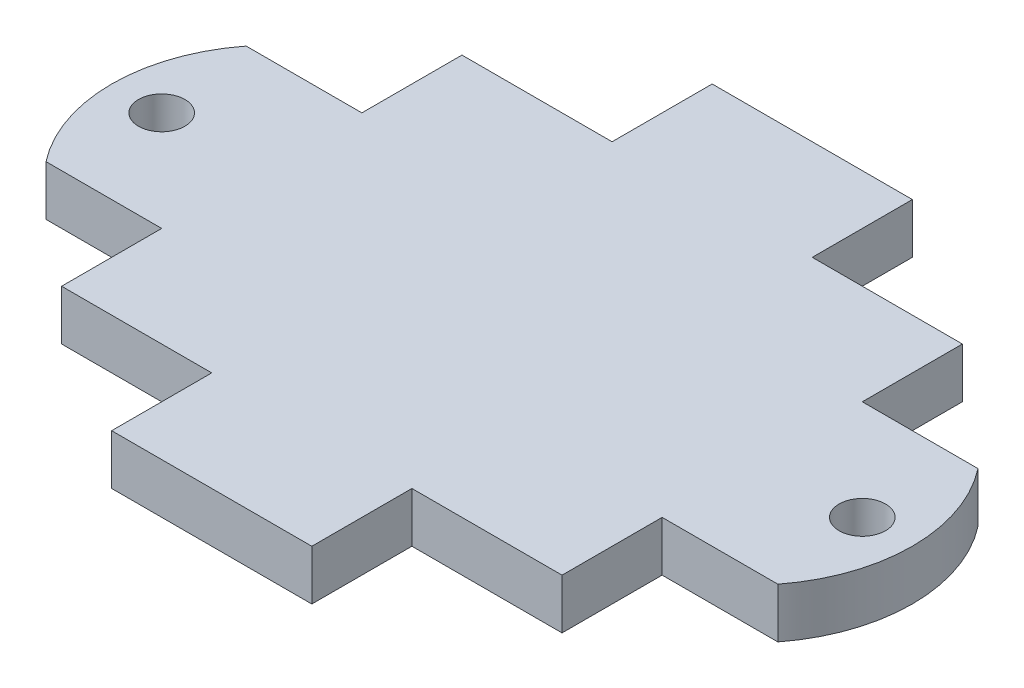
ISO-10303-21;
HEADER;
FILE_DESCRIPTION(('STEP AP214'),'2;1');
FILE_NAME('part.step','',(''),(''),'','','');
FILE_SCHEMA(('AUTOMOTIVE_DESIGN { 1 0 10303 214 1 1 1 1 }'));
ENDSEC;
DATA;
#1=APPLICATION_CONTEXT('core data for automotive mechanical design processes');
#2=APPLICATION_PROTOCOL_DEFINITION('international standard','automotive_design',2000,#1);
#3=PRODUCT_CONTEXT('',#1,'mechanical');
#4=PRODUCT('Part','Part','',(#3));
#5=PRODUCT_RELATED_PRODUCT_CATEGORY('part','',(#4));
#6=PRODUCT_DEFINITION_FORMATION('','',#4);
#7=PRODUCT_DEFINITION_CONTEXT('part definition',#1,'design');
#8=PRODUCT_DEFINITION('design','',#6,#7);
#9=PRODUCT_DEFINITION_SHAPE('','',#8);
#10=(LENGTH_UNIT() NAMED_UNIT(*) SI_UNIT(.MILLI.,.METRE.));
#11=(NAMED_UNIT(*) PLANE_ANGLE_UNIT() SI_UNIT($,.RADIAN.));
#12=(NAMED_UNIT(*) SI_UNIT($,.STERADIAN.) SOLID_ANGLE_UNIT());
#13=UNCERTAINTY_MEASURE_WITH_UNIT(LENGTH_MEASURE(1.E-05),#10,'distance_accuracy_value','');
#14=(GEOMETRIC_REPRESENTATION_CONTEXT(3) GLOBAL_UNCERTAINTY_ASSIGNED_CONTEXT((#13)) GLOBAL_UNIT_ASSIGNED_CONTEXT((#10,
#11,#12)) REPRESENTATION_CONTEXT('',''));
#15=CARTESIAN_POINT('',(0.,0.,0.));
#16=DIRECTION('',(0.,0.,1.));
#17=DIRECTION('',(1.,0.,0.));
#18=AXIS2_PLACEMENT_3D('',#15,#16,#17);
#19=CARTESIAN_POINT('',(6.35,3.175,12.7));
#20=DIRECTION('',(0.,0.,-1.));
#21=DIRECTION('',(-1.,0.,0.));
#22=AXIS2_PLACEMENT_3D('',#19,#20,#21);
#23=PLANE('',#22);
#24=DIRECTION('',(1.,0.,0.));
#25=VECTOR('',#24,1.);
#26=CARTESIAN_POINT('',(6.35,0.,12.7));
#27=LINE('',#26,#25);
#28=CARTESIAN_POINT('',(6.35,0.,12.7));
#29=VERTEX_POINT('',#28);
#30=CARTESIAN_POINT('',(15.875,0.,12.7));
#31=VERTEX_POINT('',#30);
#32=EDGE_CURVE('E201',#29,#31,#27,.T.);
#33=ORIENTED_EDGE('',*,*,#32,.T.);
#34=DIRECTION('',(0.,-1.,0.));
#35=VECTOR('',#34,1.);
#36=CARTESIAN_POINT('',(15.875,3.175,12.7));
#37=LINE('',#36,#35);
#38=CARTESIAN_POINT('',(15.875,3.175,12.7));
#39=VERTEX_POINT('',#38);
#40=EDGE_CURVE('E11',#39,#31,#37,.T.);
#41=ORIENTED_EDGE('',*,*,#40,.F.);
#42=DIRECTION('',(1.,0.,0.));
#43=VECTOR('',#42,1.);
#44=CARTESIAN_POINT('',(6.35,3.175,12.7));
#45=LINE('',#44,#43);
#46=CARTESIAN_POINT('',(6.35,3.175,12.7));
#47=VERTEX_POINT('',#46);
#48=EDGE_CURVE('E244',#47,#39,#45,.T.);
#49=ORIENTED_EDGE('',*,*,#48,.F.);
#50=DIRECTION('',(0.,-1.,0.));
#51=VECTOR('',#50,1.);
#52=CARTESIAN_POINT('',(6.35,3.175,12.7));
#53=LINE('',#52,#51);
#54=EDGE_CURVE('E197',#47,#29,#53,.T.);
#55=ORIENTED_EDGE('',*,*,#54,.T.);
#56=EDGE_LOOP('',(#33,#41,#49,#55));
#57=FACE_BOUND('',#56,.T.);
#58=ADVANCED_FACE('F33',(#57),#23,.F.);
#59=CARTESIAN_POINT('',(15.875,3.175,6.35));
#60=DIRECTION('',(-1.,0.,0.));
#61=DIRECTION('',(0.,0.,1.));
#62=AXIS2_PLACEMENT_3D('',#59,#60,#61);
#63=PLANE('',#62);
#64=DIRECTION('',(0.,0.,-1.));
#65=VECTOR('',#64,1.);
#66=CARTESIAN_POINT('',(15.875,0.,6.35));
#67=LINE('',#66,#65);
#68=CARTESIAN_POINT('',(15.875,0.,6.35));
#69=VERTEX_POINT('',#68);
#70=EDGE_CURVE('E204',#31,#69,#67,.T.);
#71=ORIENTED_EDGE('',*,*,#70,.T.);
#72=DIRECTION('',(0.,-1.,0.));
#73=VECTOR('',#72,1.);
#74=CARTESIAN_POINT('',(15.875,3.175,6.35));
#75=LINE('',#74,#73);
#76=CARTESIAN_POINT('',(15.875,3.175,6.35));
#77=VERTEX_POINT('',#76);
#78=EDGE_CURVE('E41',#77,#69,#75,.T.);
#79=ORIENTED_EDGE('',*,*,#78,.F.);
#80=DIRECTION('',(0.,0.,-1.));
#81=VECTOR('',#80,1.);
#82=CARTESIAN_POINT('',(15.875,3.175,6.35));
#83=LINE('',#82,#81);
#84=EDGE_CURVE('E128',#39,#77,#83,.T.);
#85=ORIENTED_EDGE('',*,*,#84,.F.);
#86=ORIENTED_EDGE('',*,*,#40,.T.);
#87=EDGE_LOOP('',(#71,#79,#85,#86));
#88=FACE_BOUND('',#87,.T.);
#89=ADVANCED_FACE('F295',(#88),#63,.F.);
#90=CARTESIAN_POINT('',(19.05,3.175,6.35));
#91=DIRECTION('',(0.,0.,-1.));
#92=DIRECTION('',(-1.,0.,0.));
#93=AXIS2_PLACEMENT_3D('',#90,#91,#92);
#94=PLANE('',#93);
#95=DIRECTION('',(1.,0.,0.));
#96=VECTOR('',#95,1.);
#97=CARTESIAN_POINT('',(19.05,0.,6.35));
#98=LINE('',#97,#96);
#99=CARTESIAN_POINT('',(23.2147671704804,0.,6.35));
#100=VERTEX_POINT('',#99);
#101=EDGE_CURVE('E208',#69,#100,#98,.T.);
#102=ORIENTED_EDGE('',*,*,#101,.T.);
#103=DIRECTION('',(0.,-1.,0.));
#104=VECTOR('',#103,1.);
#105=CARTESIAN_POINT('',(23.2147671704804,3.175,6.35));
#106=LINE('',#105,#104);
#107=CARTESIAN_POINT('',(23.2147671704804,3.175,6.35));
#108=VERTEX_POINT('',#107);
#109=EDGE_CURVE('E287',#108,#100,#106,.T.);
#110=ORIENTED_EDGE('',*,*,#109,.F.);
#111=DIRECTION('',(1.,0.,0.));
#112=VECTOR('',#111,1.);
#113=CARTESIAN_POINT('',(15.875,3.175,6.35));
#114=LINE('',#113,#112);
#115=EDGE_CURVE('E294',#77,#108,#114,.T.);
#116=ORIENTED_EDGE('',*,*,#115,.F.);
#117=ORIENTED_EDGE('',*,*,#78,.T.);
#118=EDGE_LOOP('',(#102,#110,#116,#117));
#119=FACE_BOUND('',#118,.T.);
#120=ADVANCED_FACE('F292',(#119),#94,.F.);
#121=CARTESIAN_POINT('',(15.08125,3.175,0.));
#122=DIRECTION('',(0.,-1.,0.));
#123=DIRECTION('',(0.,0.,-1.));
#124=AXIS2_PLACEMENT_3D('',#121,#122,#123);
#125=CYLINDRICAL_SURFACE('',#124,10.31875);
#126=CARTESIAN_POINT('',(15.08125,0.,0.));
#127=DIRECTION('',(0.,1.,0.));
#128=DIRECTION('',(0.,0.,-1.));
#129=AXIS2_PLACEMENT_3D('',#126,#127,#128);
#130=CIRCLE('',#129,10.31875);
#131=CARTESIAN_POINT('',(23.2147671704804,0.,-6.35));
#132=VERTEX_POINT('',#131);
#133=EDGE_CURVE('E210',#100,#132,#130,.T.);
#134=ORIENTED_EDGE('',*,*,#133,.T.);
#135=DIRECTION('',(0.,-1.,0.));
#136=VECTOR('',#135,1.);
#137=CARTESIAN_POINT('',(23.2147671704804,3.175,-6.35));
#138=LINE('',#137,#136);
#139=CARTESIAN_POINT('',(23.2147671704804,3.175,-6.35));
#140=VERTEX_POINT('',#139);
#141=EDGE_CURVE('E284',#140,#132,#138,.T.);
#142=ORIENTED_EDGE('',*,*,#141,.F.);
#143=CARTESIAN_POINT('',(15.08125,3.175,0.));
#144=DIRECTION('',(0.,1.,0.));
#145=DIRECTION('',(0.,0.,-1.));
#146=AXIS2_PLACEMENT_3D('',#143,#144,#145);
#147=CIRCLE('',#146,10.31875);
#148=EDGE_CURVE('E313',#108,#140,#147,.T.);
#149=ORIENTED_EDGE('',*,*,#148,.F.);
#150=ORIENTED_EDGE('',*,*,#109,.T.);
#151=EDGE_LOOP('',(#134,#142,#149,#150));
#152=FACE_BOUND('',#151,.T.);
#153=ADVANCED_FACE('F304',(#152),#125,.T.);
#154=CARTESIAN_POINT('',(15.875,3.175,-6.35));
#155=DIRECTION('',(0.,0.,1.));
#156=DIRECTION('',(1.,0.,0.));
#157=AXIS2_PLACEMENT_3D('',#154,#155,#156);
#158=PLANE('',#157);
#159=DIRECTION('',(-1.,0.,0.));
#160=VECTOR('',#159,1.);
#161=CARTESIAN_POINT('',(15.875,0.,-6.35));
#162=LINE('',#161,#160);
#163=CARTESIAN_POINT('',(15.875,0.,-6.35));
#164=VERTEX_POINT('',#163);
#165=EDGE_CURVE('E213',#132,#164,#162,.T.);
#166=ORIENTED_EDGE('',*,*,#165,.T.);
#167=DIRECTION('',(0.,-1.,0.));
#168=VECTOR('',#167,1.);
#169=CARTESIAN_POINT('',(15.875,3.175,-6.35));
#170=LINE('',#169,#168);
#171=CARTESIAN_POINT('',(15.875,3.175,-6.35));
#172=VERTEX_POINT('',#171);
#173=EDGE_CURVE('E281',#172,#164,#170,.T.);
#174=ORIENTED_EDGE('',*,*,#173,.F.);
#175=DIRECTION('',(-1.,0.,0.));
#176=VECTOR('',#175,1.);
#177=CARTESIAN_POINT('',(19.05,3.175,-6.35));
#178=LINE('',#177,#176);
#179=EDGE_CURVE('E310',#140,#172,#178,.T.);
#180=ORIENTED_EDGE('',*,*,#179,.F.);
#181=ORIENTED_EDGE('',*,*,#141,.T.);
#182=EDGE_LOOP('',(#166,#174,#180,#181));
#183=FACE_BOUND('',#182,.T.);
#184=ADVANCED_FACE('F308',(#183),#158,.F.);
#185=CARTESIAN_POINT('',(15.875,3.175,-12.7));
#186=DIRECTION('',(-1.,0.,0.));
#187=DIRECTION('',(0.,0.,1.));
#188=AXIS2_PLACEMENT_3D('',#185,#186,#187);
#189=PLANE('',#188);
#190=DIRECTION('',(0.,0.,-1.));
#191=VECTOR('',#190,1.);
#192=CARTESIAN_POINT('',(15.875,0.,-12.7));
#193=LINE('',#192,#191);
#194=CARTESIAN_POINT('',(15.875,0.,-12.7));
#195=VERTEX_POINT('',#194);
#196=EDGE_CURVE('E215',#164,#195,#193,.T.);
#197=ORIENTED_EDGE('',*,*,#196,.T.);
#198=DIRECTION('',(0.,-1.,0.));
#199=VECTOR('',#198,1.);
#200=CARTESIAN_POINT('',(15.875,3.175,-12.7));
#201=LINE('',#200,#199);
#202=CARTESIAN_POINT('',(15.875,3.175,-12.7));
#203=VERTEX_POINT('',#202);
#204=EDGE_CURVE('E278',#203,#195,#201,.T.);
#205=ORIENTED_EDGE('',*,*,#204,.F.);
#206=DIRECTION('',(0.,0.,-1.));
#207=VECTOR('',#206,1.);
#208=CARTESIAN_POINT('',(15.875,3.175,-12.7));
#209=LINE('',#208,#207);
#210=EDGE_CURVE('E312',#172,#203,#209,.T.);
#211=ORIENTED_EDGE('',*,*,#210,.F.);
#212=ORIENTED_EDGE('',*,*,#173,.T.);
#213=EDGE_LOOP('',(#197,#205,#211,#212));
#214=FACE_BOUND('',#213,.T.);
#215=ADVANCED_FACE('F548',(#214),#189,.F.);
#216=CARTESIAN_POINT('',(6.35,3.175,-12.7));
#217=DIRECTION('',(0.,0.,1.));
#218=DIRECTION('',(1.,0.,0.));
#219=AXIS2_PLACEMENT_3D('',#216,#217,#218);
#220=PLANE('',#219);
#221=DIRECTION('',(-1.,0.,0.));
#222=VECTOR('',#221,1.);
#223=CARTESIAN_POINT('',(6.35,0.,-12.7));
#224=LINE('',#223,#222);
#225=CARTESIAN_POINT('',(6.35,0.,-12.7));
#226=VERTEX_POINT('',#225);
#227=EDGE_CURVE('E217',#195,#226,#224,.T.);
#228=ORIENTED_EDGE('',*,*,#227,.T.);
#229=DIRECTION('',(0.,-1.,0.));
#230=VECTOR('',#229,1.);
#231=CARTESIAN_POINT('',(6.35,3.175,-12.7));
#232=LINE('',#231,#230);
#233=CARTESIAN_POINT('',(6.35,3.175,-12.7));
#234=VERTEX_POINT('',#233);
#235=EDGE_CURVE('E275',#234,#226,#232,.T.);
#236=ORIENTED_EDGE('',*,*,#235,.F.);
#237=DIRECTION('',(-1.,0.,0.));
#238=VECTOR('',#237,1.);
#239=CARTESIAN_POINT('',(6.35,3.175,-12.7));
#240=LINE('',#239,#238);
#241=EDGE_CURVE('E315',#203,#234,#240,.T.);
#242=ORIENTED_EDGE('',*,*,#241,.F.);
#243=ORIENTED_EDGE('',*,*,#204,.T.);
#244=EDGE_LOOP('',(#228,#236,#242,#243));
#245=FACE_BOUND('',#244,.T.);
#246=ADVANCED_FACE('F538',(#245),#220,.F.);
#247=CARTESIAN_POINT('',(6.35,3.175,-12.7));
#248=DIRECTION('',(-1.,0.,0.));
#249=DIRECTION('',(0.,0.,1.));
#250=AXIS2_PLACEMENT_3D('',#247,#248,#249);
#251=PLANE('',#250);
#252=DIRECTION('',(0.,0.,-1.));
#253=VECTOR('',#252,1.);
#254=CARTESIAN_POINT('',(6.35,0.,-12.7));
#255=LINE('',#254,#253);
#256=CARTESIAN_POINT('',(6.35,0.,-19.05));
#257=VERTEX_POINT('',#256);
#258=EDGE_CURVE('E219',#226,#257,#255,.T.);
#259=ORIENTED_EDGE('',*,*,#258,.T.);
#260=DIRECTION('',(0.,-1.,0.));
#261=VECTOR('',#260,1.);
#262=CARTESIAN_POINT('',(6.35,3.175,-19.05));
#263=LINE('',#262,#261);
#264=CARTESIAN_POINT('',(6.35,3.175,-19.05));
#265=VERTEX_POINT('',#264);
#266=EDGE_CURVE('E272',#265,#257,#263,.T.);
#267=ORIENTED_EDGE('',*,*,#266,.F.);
#268=DIRECTION('',(0.,0.,-1.));
#269=VECTOR('',#268,1.);
#270=CARTESIAN_POINT('',(6.35,3.175,-12.7));
#271=LINE('',#270,#269);
#272=EDGE_CURVE('E321',#234,#265,#271,.T.);
#273=ORIENTED_EDGE('',*,*,#272,.F.);
#274=ORIENTED_EDGE('',*,*,#235,.T.);
#275=EDGE_LOOP('',(#259,#267,#273,#274));
#276=FACE_BOUND('',#275,.T.);
#277=ADVANCED_FACE('F528',(#276),#251,.F.);
#278=CARTESIAN_POINT('',(-6.35,3.175,-19.05));
#279=DIRECTION('',(0.,0.,1.));
#280=DIRECTION('',(1.,0.,0.));
#281=AXIS2_PLACEMENT_3D('',#278,#279,#280);
#282=PLANE('',#281);
#283=DIRECTION('',(-1.,0.,0.));
#284=VECTOR('',#283,1.);
#285=CARTESIAN_POINT('',(-6.35,0.,-19.05));
#286=LINE('',#285,#284);
#287=CARTESIAN_POINT('',(-6.35,0.,-19.05));
#288=VERTEX_POINT('',#287);
#289=EDGE_CURVE('E221',#257,#288,#286,.T.);
#290=ORIENTED_EDGE('',*,*,#289,.T.);
#291=DIRECTION('',(0.,-1.,0.));
#292=VECTOR('',#291,1.);
#293=CARTESIAN_POINT('',(-6.35,3.175,-19.05));
#294=LINE('',#293,#292);
#295=CARTESIAN_POINT('',(-6.35,3.175,-19.05));
#296=VERTEX_POINT('',#295);
#297=EDGE_CURVE('E269',#296,#288,#294,.T.);
#298=ORIENTED_EDGE('',*,*,#297,.F.);
#299=DIRECTION('',(-1.,0.,0.));
#300=VECTOR('',#299,1.);
#301=CARTESIAN_POINT('',(-6.35,3.175,-19.05));
#302=LINE('',#301,#300);
#303=EDGE_CURVE('E323',#265,#296,#302,.T.);
#304=ORIENTED_EDGE('',*,*,#303,.F.);
#305=ORIENTED_EDGE('',*,*,#266,.T.);
#306=EDGE_LOOP('',(#290,#298,#304,#305));
#307=FACE_BOUND('',#306,.T.);
#308=ADVANCED_FACE('F518',(#307),#282,.F.);
#309=CARTESIAN_POINT('',(-6.35,3.175,-12.7));
#310=DIRECTION('',(1.,0.,0.));
#311=DIRECTION('',(0.,0.,-1.));
#312=AXIS2_PLACEMENT_3D('',#309,#310,#311);
#313=PLANE('',#312);
#314=DIRECTION('',(0.,0.,1.));
#315=VECTOR('',#314,1.);
#316=CARTESIAN_POINT('',(-6.35,0.,-12.7));
#317=LINE('',#316,#315);
#318=CARTESIAN_POINT('',(-6.35,0.,-12.7));
#319=VERTEX_POINT('',#318);
#320=EDGE_CURVE('E223',#288,#319,#317,.T.);
#321=ORIENTED_EDGE('',*,*,#320,.T.);
#322=DIRECTION('',(0.,-1.,0.));
#323=VECTOR('',#322,1.);
#324=CARTESIAN_POINT('',(-6.35,3.175,-12.7));
#325=LINE('',#324,#323);
#326=CARTESIAN_POINT('',(-6.35,3.175,-12.7));
#327=VERTEX_POINT('',#326);
#328=EDGE_CURVE('E266',#327,#319,#325,.T.);
#329=ORIENTED_EDGE('',*,*,#328,.F.);
#330=DIRECTION('',(0.,0.,1.));
#331=VECTOR('',#330,1.);
#332=CARTESIAN_POINT('',(-6.35,3.175,-12.7));
#333=LINE('',#332,#331);
#334=EDGE_CURVE('E325',#296,#327,#333,.T.);
#335=ORIENTED_EDGE('',*,*,#334,.F.);
#336=ORIENTED_EDGE('',*,*,#297,.T.);
#337=EDGE_LOOP('',(#321,#329,#335,#336));
#338=FACE_BOUND('',#337,.T.);
#339=ADVANCED_FACE('F508',(#338),#313,.F.);
#340=CARTESIAN_POINT('',(-15.875,3.175,-12.7));
#341=DIRECTION('',(0.,0.,1.));
#342=DIRECTION('',(1.,0.,0.));
#343=AXIS2_PLACEMENT_3D('',#340,#341,#342);
#344=PLANE('',#343);
#345=DIRECTION('',(-1.,0.,0.));
#346=VECTOR('',#345,1.);
#347=CARTESIAN_POINT('',(-15.875,0.,-12.7));
#348=LINE('',#347,#346);
#349=CARTESIAN_POINT('',(-15.875,0.,-12.7));
#350=VERTEX_POINT('',#349);
#351=EDGE_CURVE('E225',#319,#350,#348,.T.);
#352=ORIENTED_EDGE('',*,*,#351,.T.);
#353=DIRECTION('',(0.,-1.,0.));
#354=VECTOR('',#353,1.);
#355=CARTESIAN_POINT('',(-15.875,3.175,-12.7));
#356=LINE('',#355,#354);
#357=CARTESIAN_POINT('',(-15.875,3.175,-12.7));
#358=VERTEX_POINT('',#357);
#359=EDGE_CURVE('E263',#358,#350,#356,.T.);
#360=ORIENTED_EDGE('',*,*,#359,.F.);
#361=DIRECTION('',(-1.,0.,0.));
#362=VECTOR('',#361,1.);
#363=CARTESIAN_POINT('',(-15.875,3.175,-12.7));
#364=LINE('',#363,#362);
#365=EDGE_CURVE('E327',#327,#358,#364,.T.);
#366=ORIENTED_EDGE('',*,*,#365,.F.);
#367=ORIENTED_EDGE('',*,*,#328,.T.);
#368=EDGE_LOOP('',(#352,#360,#366,#367));
#369=FACE_BOUND('',#368,.T.);
#370=ADVANCED_FACE('F498',(#369),#344,.F.);
#371=CARTESIAN_POINT('',(-15.875,3.175,-12.7));
#372=DIRECTION('',(1.,0.,0.));
#373=DIRECTION('',(0.,0.,-1.));
#374=AXIS2_PLACEMENT_3D('',#371,#372,#373);
#375=PLANE('',#374);
#376=DIRECTION('',(0.,0.,1.));
#377=VECTOR('',#376,1.);
#378=CARTESIAN_POINT('',(-15.875,0.,-12.7));
#379=LINE('',#378,#377);
#380=CARTESIAN_POINT('',(-15.875,0.,-6.35));
#381=VERTEX_POINT('',#380);
#382=EDGE_CURVE('E227',#350,#381,#379,.T.);
#383=ORIENTED_EDGE('',*,*,#382,.T.);
#384=DIRECTION('',(0.,-1.,0.));
#385=VECTOR('',#384,1.);
#386=CARTESIAN_POINT('',(-15.875,3.175,-6.35));
#387=LINE('',#386,#385);
#388=CARTESIAN_POINT('',(-15.875,3.175,-6.35));
#389=VERTEX_POINT('',#388);
#390=EDGE_CURVE('E260',#389,#381,#387,.T.);
#391=ORIENTED_EDGE('',*,*,#390,.F.);
#392=DIRECTION('',(0.,0.,1.));
#393=VECTOR('',#392,1.);
#394=CARTESIAN_POINT('',(-15.875,3.175,-12.7));
#395=LINE('',#394,#393);
#396=EDGE_CURVE('E329',#358,#389,#395,.T.);
#397=ORIENTED_EDGE('',*,*,#396,.F.);
#398=ORIENTED_EDGE('',*,*,#359,.T.);
#399=EDGE_LOOP('',(#383,#391,#397,#398));
#400=FACE_BOUND('',#399,.T.);
#401=ADVANCED_FACE('F487',(#400),#375,.F.);
#402=CARTESIAN_POINT('',(-19.05,3.175,-6.35));
#403=DIRECTION('',(0.,0.,1.));
#404=DIRECTION('',(1.,0.,0.));
#405=AXIS2_PLACEMENT_3D('',#402,#403,#404);
#406=PLANE('',#405);
#407=DIRECTION('',(-1.,0.,0.));
#408=VECTOR('',#407,1.);
#409=CARTESIAN_POINT('',(-19.05,0.,-6.35));
#410=LINE('',#409,#408);
#411=CARTESIAN_POINT('',(-23.2147671704804,0.,-6.35));
#412=VERTEX_POINT('',#411);
#413=EDGE_CURVE('E230',#381,#412,#410,.T.);
#414=ORIENTED_EDGE('',*,*,#413,.T.);
#415=DIRECTION('',(0.,-1.,0.));
#416=VECTOR('',#415,1.);
#417=CARTESIAN_POINT('',(-23.2147671704804,3.175,-6.35));
#418=LINE('',#417,#416);
#419=CARTESIAN_POINT('',(-23.2147671704804,3.175,-6.35));
#420=VERTEX_POINT('',#419);
#421=EDGE_CURVE('E257',#420,#412,#418,.T.);
#422=ORIENTED_EDGE('',*,*,#421,.F.);
#423=DIRECTION('',(-1.,0.,0.));
#424=VECTOR('',#423,1.);
#425=CARTESIAN_POINT('',(-15.875,3.175,-6.35));
#426=LINE('',#425,#424);
#427=EDGE_CURVE('E331',#389,#420,#426,.T.);
#428=ORIENTED_EDGE('',*,*,#427,.F.);
#429=ORIENTED_EDGE('',*,*,#390,.T.);
#430=EDGE_LOOP('',(#414,#422,#428,#429));
#431=FACE_BOUND('',#430,.T.);
#432=ADVANCED_FACE('F363',(#431),#406,.F.);
#433=CARTESIAN_POINT('',(-15.08125,3.175,0.));
#434=DIRECTION('',(0.,-1.,0.));
#435=DIRECTION('',(0.,0.,-1.));
#436=AXIS2_PLACEMENT_3D('',#433,#434,#435);
#437=CYLINDRICAL_SURFACE('',#436,10.31875);
#438=CARTESIAN_POINT('',(-15.08125,0.,0.));
#439=DIRECTION('',(0.,1.,0.));
#440=DIRECTION('',(0.,0.,1.));
#441=AXIS2_PLACEMENT_3D('',#438,#439,#440);
#442=CIRCLE('',#441,10.31875);
#443=CARTESIAN_POINT('',(-23.2147671704804,0.,6.35));
#444=VERTEX_POINT('',#443);
#445=EDGE_CURVE('E232',#412,#444,#442,.T.);
#446=ORIENTED_EDGE('',*,*,#445,.T.);
#447=DIRECTION('',(0.,-1.,0.));
#448=VECTOR('',#447,1.);
#449=CARTESIAN_POINT('',(-23.2147671704804,3.175,6.35));
#450=LINE('',#449,#448);
#451=CARTESIAN_POINT('',(-23.2147671704804,3.175,6.35));
#452=VERTEX_POINT('',#451);
#453=EDGE_CURVE('E254',#452,#444,#450,.T.);
#454=ORIENTED_EDGE('',*,*,#453,.F.);
#455=CARTESIAN_POINT('',(-15.08125,3.175,0.));
#456=DIRECTION('',(0.,1.,0.));
#457=DIRECTION('',(0.,0.,1.));
#458=AXIS2_PLACEMENT_3D('',#455,#456,#457);
#459=CIRCLE('',#458,10.31875);
#460=EDGE_CURVE('E333',#420,#452,#459,.T.);
#461=ORIENTED_EDGE('',*,*,#460,.F.);
#462=ORIENTED_EDGE('',*,*,#421,.T.);
#463=EDGE_LOOP('',(#446,#454,#461,#462));
#464=FACE_BOUND('',#463,.T.);
#465=ADVANCED_FACE('F352',(#464),#437,.T.);
#466=CARTESIAN_POINT('',(-15.875,3.175,6.35));
#467=DIRECTION('',(0.,0.,-1.));
#468=DIRECTION('',(-1.,0.,0.));
#469=AXIS2_PLACEMENT_3D('',#466,#467,#468);
#470=PLANE('',#469);
#471=DIRECTION('',(1.,0.,0.));
#472=VECTOR('',#471,1.);
#473=CARTESIAN_POINT('',(-15.875,0.,6.35));
#474=LINE('',#473,#472);
#475=CARTESIAN_POINT('',(-15.875,0.,6.35));
#476=VERTEX_POINT('',#475);
#477=EDGE_CURVE('E235',#444,#476,#474,.T.);
#478=ORIENTED_EDGE('',*,*,#477,.T.);
#479=DIRECTION('',(0.,-1.,0.));
#480=VECTOR('',#479,1.);
#481=CARTESIAN_POINT('',(-15.875,3.175,6.35));
#482=LINE('',#481,#480);
#483=CARTESIAN_POINT('',(-15.875,3.175,6.35));
#484=VERTEX_POINT('',#483);
#485=EDGE_CURVE('E251',#484,#476,#482,.T.);
#486=ORIENTED_EDGE('',*,*,#485,.F.);
#487=DIRECTION('',(1.,0.,0.));
#488=VECTOR('',#487,1.);
#489=CARTESIAN_POINT('',(-19.05,3.175,6.35));
#490=LINE('',#489,#488);
#491=EDGE_CURVE('E335',#452,#484,#490,.T.);
#492=ORIENTED_EDGE('',*,*,#491,.F.);
#493=ORIENTED_EDGE('',*,*,#453,.T.);
#494=EDGE_LOOP('',(#478,#486,#492,#493));
#495=FACE_BOUND('',#494,.T.);
#496=ADVANCED_FACE('F355',(#495),#470,.F.);
#497=CARTESIAN_POINT('',(-15.875,3.175,6.35));
#498=DIRECTION('',(1.,0.,0.));
#499=DIRECTION('',(0.,0.,-1.));
#500=AXIS2_PLACEMENT_3D('',#497,#498,#499);
#501=PLANE('',#500);
#502=DIRECTION('',(0.,0.,1.));
#503=VECTOR('',#502,1.);
#504=CARTESIAN_POINT('',(-15.875,0.,6.35));
#505=LINE('',#504,#503);
#506=CARTESIAN_POINT('',(-15.875,0.,12.7));
#507=VERTEX_POINT('',#506);
#508=EDGE_CURVE('E237',#476,#507,#505,.T.);
#509=ORIENTED_EDGE('',*,*,#508,.T.);
#510=DIRECTION('',(0.,-1.,0.));
#511=VECTOR('',#510,1.);
#512=CARTESIAN_POINT('',(-15.875,3.175,12.7));
#513=LINE('',#512,#511);
#514=CARTESIAN_POINT('',(-15.875,3.175,12.7));
#515=VERTEX_POINT('',#514);
#516=EDGE_CURVE('E248',#515,#507,#513,.T.);
#517=ORIENTED_EDGE('',*,*,#516,.F.);
#518=DIRECTION('',(0.,0.,1.));
#519=VECTOR('',#518,1.);
#520=CARTESIAN_POINT('',(-15.875,3.175,6.35));
#521=LINE('',#520,#519);
#522=EDGE_CURVE('E337',#484,#515,#521,.T.);
#523=ORIENTED_EDGE('',*,*,#522,.F.);
#524=ORIENTED_EDGE('',*,*,#485,.T.);
#525=EDGE_LOOP('',(#509,#517,#523,#524));
#526=FACE_BOUND('',#525,.T.);
#527=ADVANCED_FACE('F343',(#526),#501,.F.);
#528=CARTESIAN_POINT('',(-15.875,3.175,12.7));
#529=DIRECTION('',(0.,0.,-1.));
#530=DIRECTION('',(-1.,0.,0.));
#531=AXIS2_PLACEMENT_3D('',#528,#529,#530);
#532=PLANE('',#531);
#533=DIRECTION('',(1.,0.,0.));
#534=VECTOR('',#533,1.);
#535=CARTESIAN_POINT('',(-15.875,0.,12.7));
#536=LINE('',#535,#534);
#537=CARTESIAN_POINT('',(-6.35,0.,12.7));
#538=VERTEX_POINT('',#537);
#539=EDGE_CURVE('E239',#507,#538,#536,.T.);
#540=ORIENTED_EDGE('',*,*,#539,.T.);
#541=DIRECTION('',(0.,-1.,0.));
#542=VECTOR('',#541,1.);
#543=CARTESIAN_POINT('',(-6.35,3.175,12.7));
#544=LINE('',#543,#542);
#545=CARTESIAN_POINT('',(-6.35,3.175,12.7));
#546=VERTEX_POINT('',#545);
#547=EDGE_CURVE('E192',#546,#538,#544,.T.);
#548=ORIENTED_EDGE('',*,*,#547,.F.);
#549=DIRECTION('',(1.,0.,0.));
#550=VECTOR('',#549,1.);
#551=CARTESIAN_POINT('',(-15.875,3.175,12.7));
#552=LINE('',#551,#550);
#553=EDGE_CURVE('E183',#515,#546,#552,.T.);
#554=ORIENTED_EDGE('',*,*,#553,.F.);
#555=ORIENTED_EDGE('',*,*,#516,.T.);
#556=EDGE_LOOP('',(#540,#548,#554,#555));
#557=FACE_BOUND('',#556,.T.);
#558=ADVANCED_FACE('F347',(#557),#532,.F.);
#559=CARTESIAN_POINT('',(-6.35,3.175,12.7));
#560=DIRECTION('',(1.,0.,0.));
#561=DIRECTION('',(0.,0.,-1.));
#562=AXIS2_PLACEMENT_3D('',#559,#560,#561);
#563=PLANE('',#562);
#564=DIRECTION('',(0.,0.,1.));
#565=VECTOR('',#564,1.);
#566=CARTESIAN_POINT('',(-6.35,0.,12.7));
#567=LINE('',#566,#565);
#568=CARTESIAN_POINT('',(-6.35,0.,19.05));
#569=VERTEX_POINT('',#568);
#570=EDGE_CURVE('E191',#538,#569,#567,.T.);
#571=ORIENTED_EDGE('',*,*,#570,.T.);
#572=DIRECTION('',(0.,-1.,0.));
#573=VECTOR('',#572,1.);
#574=CARTESIAN_POINT('',(-6.35,3.175,19.05));
#575=LINE('',#574,#573);
#576=CARTESIAN_POINT('',(-6.35,3.175,19.05));
#577=VERTEX_POINT('',#576);
#578=EDGE_CURVE('E188',#577,#569,#575,.T.);
#579=ORIENTED_EDGE('',*,*,#578,.F.);
#580=DIRECTION('',(0.,0.,1.));
#581=VECTOR('',#580,1.);
#582=CARTESIAN_POINT('',(-6.35,3.175,12.7));
#583=LINE('',#582,#581);
#584=EDGE_CURVE('E177',#546,#577,#583,.T.);
#585=ORIENTED_EDGE('',*,*,#584,.F.);
#586=ORIENTED_EDGE('',*,*,#547,.T.);
#587=EDGE_LOOP('',(#571,#579,#585,#586));
#588=FACE_BOUND('',#587,.T.);
#589=ADVANCED_FACE('F189',(#588),#563,.F.);
#590=CARTESIAN_POINT('',(-6.35,3.175,19.05));
#591=DIRECTION('',(0.,0.,-1.));
#592=DIRECTION('',(-1.,0.,0.));
#593=AXIS2_PLACEMENT_3D('',#590,#591,#592);
#594=PLANE('',#593);
#595=DIRECTION('',(1.,0.,0.));
#596=VECTOR('',#595,1.);
#597=CARTESIAN_POINT('',(-6.35,0.,19.05));
#598=LINE('',#597,#596);
#599=CARTESIAN_POINT('',(6.35,0.,19.05));
#600=VERTEX_POINT('',#599);
#601=EDGE_CURVE('E114',#569,#600,#598,.T.);
#602=ORIENTED_EDGE('',*,*,#601,.T.);
#603=DIRECTION('',(0.,-1.,0.));
#604=VECTOR('',#603,1.);
#605=CARTESIAN_POINT('',(6.35,3.175,19.05));
#606=LINE('',#605,#604);
#607=CARTESIAN_POINT('',(6.35,3.175,19.05));
#608=VERTEX_POINT('',#607);
#609=EDGE_CURVE('E193',#608,#600,#606,.T.);
#610=ORIENTED_EDGE('',*,*,#609,.F.);
#611=DIRECTION('',(1.,0.,0.));
#612=VECTOR('',#611,1.);
#613=CARTESIAN_POINT('',(-6.35,3.175,19.05));
#614=LINE('',#613,#612);
#615=EDGE_CURVE('E181',#577,#608,#614,.T.);
#616=ORIENTED_EDGE('',*,*,#615,.F.);
#617=ORIENTED_EDGE('',*,*,#578,.T.);
#618=EDGE_LOOP('',(#602,#610,#616,#617));
#619=FACE_BOUND('',#618,.T.);
#620=ADVANCED_FACE('F195',(#619),#594,.F.);
#621=CARTESIAN_POINT('',(6.35,3.175,12.7));
#622=DIRECTION('',(-1.,0.,0.));
#623=DIRECTION('',(0.,0.,1.));
#624=AXIS2_PLACEMENT_3D('',#621,#622,#623);
#625=PLANE('',#624);
#626=DIRECTION('',(0.,0.,-1.));
#627=VECTOR('',#626,1.);
#628=CARTESIAN_POINT('',(6.35,0.,12.7));
#629=LINE('',#628,#627);
#630=EDGE_CURVE('E120',#600,#29,#629,.T.);
#631=ORIENTED_EDGE('',*,*,#630,.T.);
#632=ORIENTED_EDGE('',*,*,#54,.F.);
#633=DIRECTION('',(0.,0.,-1.));
#634=VECTOR('',#633,1.);
#635=CARTESIAN_POINT('',(6.35,3.175,12.7));
#636=LINE('',#635,#634);
#637=EDGE_CURVE('E49',#608,#47,#636,.T.);
#638=ORIENTED_EDGE('',*,*,#637,.F.);
#639=ORIENTED_EDGE('',*,*,#609,.T.);
#640=EDGE_LOOP('',(#631,#632,#638,#639));
#641=FACE_BOUND('',#640,.T.);
#642=ADVANCED_FACE('F371',(#641),#625,.F.);
#643=CARTESIAN_POINT('',(15.08125,3.175,0.));
#644=DIRECTION('',(0.,-1.,0.));
#645=DIRECTION('',(0.,0.,-1.));
#646=AXIS2_PLACEMENT_3D('',#643,#644,#645);
#647=PLANE('',#646);
#648=CARTESIAN_POINT('',(22.225,3.175,0.));
#649=DIRECTION('',(0.,1.,0.));
#650=DIRECTION('',(0.,0.,1.));
#651=AXIS2_PLACEMENT_3D('',#648,#649,#650);
#652=CIRCLE('',#651,1.47319999999999);
#653=CARTESIAN_POINT('',(22.225,3.175,1.47319999999999));
#654=VERTEX_POINT('',#653);
#655=EDGE_CURVE('E446',#654,#654,#652,.T.);
#656=ORIENTED_EDGE('',*,*,#655,.F.);
#657=EDGE_LOOP('',(#656));
#658=FACE_BOUND('',#657,.T.);
#659=CARTESIAN_POINT('',(-22.225,3.175,0.));
#660=DIRECTION('',(0.,1.,0.));
#661=DIRECTION('',(0.,0.,1.));
#662=AXIS2_PLACEMENT_3D('',#659,#660,#661);
#663=CIRCLE('',#662,1.47319999999999);
#664=CARTESIAN_POINT('',(-22.225,3.175,1.47319999999999));
#665=VERTEX_POINT('',#664);
#666=EDGE_CURVE('E448',#665,#665,#663,.T.);
#667=ORIENTED_EDGE('',*,*,#666,.F.);
#668=EDGE_LOOP('',(#667));
#669=FACE_BOUND('',#668,.T.);
#670=ORIENTED_EDGE('',*,*,#48,.T.);
#671=ORIENTED_EDGE('',*,*,#84,.T.);
#672=ORIENTED_EDGE('',*,*,#115,.T.);
#673=ORIENTED_EDGE('',*,*,#148,.T.);
#674=ORIENTED_EDGE('',*,*,#179,.T.);
#675=ORIENTED_EDGE('',*,*,#210,.T.);
#676=ORIENTED_EDGE('',*,*,#241,.T.);
#677=ORIENTED_EDGE('',*,*,#272,.T.);
#678=ORIENTED_EDGE('',*,*,#303,.T.);
#679=ORIENTED_EDGE('',*,*,#334,.T.);
#680=ORIENTED_EDGE('',*,*,#365,.T.);
#681=ORIENTED_EDGE('',*,*,#396,.T.);
#682=ORIENTED_EDGE('',*,*,#427,.T.);
#683=ORIENTED_EDGE('',*,*,#460,.T.);
#684=ORIENTED_EDGE('',*,*,#491,.T.);
#685=ORIENTED_EDGE('',*,*,#522,.T.);
#686=ORIENTED_EDGE('',*,*,#553,.T.);
#687=ORIENTED_EDGE('',*,*,#584,.T.);
#688=ORIENTED_EDGE('',*,*,#615,.T.);
#689=ORIENTED_EDGE('',*,*,#637,.T.);
#690=EDGE_LOOP('',(#670,#671,#672,#673,#674,#675,#676,#677,#678,#679,#680,#681,#682,#683,#684,
#685,#686,#687,#688,#689));
#691=FACE_BOUND('',#690,.T.);
#692=ADVANCED_FACE('F179',(#658,#669,#691),#647,.F.);
#693=CARTESIAN_POINT('',(15.08125,0.,0.));
#694=DIRECTION('',(0.,-1.,0.));
#695=DIRECTION('',(0.,0.,-1.));
#696=AXIS2_PLACEMENT_3D('',#693,#694,#695);
#697=PLANE('',#696);
#698=CARTESIAN_POINT('',(22.225,0.,0.));
#699=DIRECTION('',(0.,-1.,0.));
#700=DIRECTION('',(0.,0.,-1.));
#701=AXIS2_PLACEMENT_3D('',#698,#699,#700);
#702=CIRCLE('',#701,1.47319999999999);
#703=CARTESIAN_POINT('',(22.225,0.,-1.47319999999999));
#704=VERTEX_POINT('',#703);
#705=EDGE_CURVE('E443',#704,#704,#702,.T.);
#706=ORIENTED_EDGE('',*,*,#705,.F.);
#707=EDGE_LOOP('',(#706));
#708=FACE_BOUND('',#707,.T.);
#709=CARTESIAN_POINT('',(-22.225,0.,0.));
#710=DIRECTION('',(0.,-1.,0.));
#711=DIRECTION('',(0.,0.,-1.));
#712=AXIS2_PLACEMENT_3D('',#709,#710,#711);
#713=CIRCLE('',#712,1.47319999999999);
#714=CARTESIAN_POINT('',(-22.225,0.,-1.47319999999999));
#715=VERTEX_POINT('',#714);
#716=EDGE_CURVE('E205',#715,#715,#713,.T.);
#717=ORIENTED_EDGE('',*,*,#716,.F.);
#718=EDGE_LOOP('',(#717));
#719=FACE_BOUND('',#718,.T.);
#720=ORIENTED_EDGE('',*,*,#32,.F.);
#721=ORIENTED_EDGE('',*,*,#630,.F.);
#722=ORIENTED_EDGE('',*,*,#601,.F.);
#723=ORIENTED_EDGE('',*,*,#570,.F.);
#724=ORIENTED_EDGE('',*,*,#539,.F.);
#725=ORIENTED_EDGE('',*,*,#508,.F.);
#726=ORIENTED_EDGE('',*,*,#477,.F.);
#727=ORIENTED_EDGE('',*,*,#445,.F.);
#728=ORIENTED_EDGE('',*,*,#413,.F.);
#729=ORIENTED_EDGE('',*,*,#382,.F.);
#730=ORIENTED_EDGE('',*,*,#351,.F.);
#731=ORIENTED_EDGE('',*,*,#320,.F.);
#732=ORIENTED_EDGE('',*,*,#289,.F.);
#733=ORIENTED_EDGE('',*,*,#258,.F.);
#734=ORIENTED_EDGE('',*,*,#227,.F.);
#735=ORIENTED_EDGE('',*,*,#196,.F.);
#736=ORIENTED_EDGE('',*,*,#165,.F.);
#737=ORIENTED_EDGE('',*,*,#133,.F.);
#738=ORIENTED_EDGE('',*,*,#101,.F.);
#739=ORIENTED_EDGE('',*,*,#70,.F.);
#740=EDGE_LOOP('',(#720,#721,#722,#723,#724,#725,#726,#727,#728,#729,#730,#731,#732,#733,#734,
#735,#736,#737,#738,#739));
#741=FACE_BOUND('',#740,.T.);
#742=ADVANCED_FACE('F299',(#708,#719,#741),#697,.T.);
#743=CARTESIAN_POINT('',(-22.225,3.175,0.));
#744=DIRECTION('',(0.,1.,0.));
#745=DIRECTION('',(0.,0.,1.));
#746=AXIS2_PLACEMENT_3D('',#743,#744,#745);
#747=CYLINDRICAL_SURFACE('',#746,1.47319999999999);
#748=ORIENTED_EDGE('',*,*,#716,.T.);
#749=EDGE_LOOP('',(#748));
#750=FACE_BOUND('',#749,.T.);
#751=ORIENTED_EDGE('',*,*,#666,.T.);
#752=EDGE_LOOP('',(#751));
#753=FACE_BOUND('',#752,.T.);
#754=ADVANCED_FACE('F417',(#750,#753),#747,.F.);
#755=CARTESIAN_POINT('',(22.225,3.175,0.));
#756=DIRECTION('',(0.,1.,0.));
#757=DIRECTION('',(0.,0.,1.));
#758=AXIS2_PLACEMENT_3D('',#755,#756,#757);
#759=CYLINDRICAL_SURFACE('',#758,1.47319999999999);
#760=ORIENTED_EDGE('',*,*,#705,.T.);
#761=EDGE_LOOP('',(#760));
#762=FACE_BOUND('',#761,.T.);
#763=ORIENTED_EDGE('',*,*,#655,.T.);
#764=EDGE_LOOP('',(#763));
#765=FACE_BOUND('',#764,.T.);
#766=ADVANCED_FACE('F426',(#762,#765),#759,.F.);
#767=CLOSED_SHELL('',(#58,#89,#120,#153,#184,#215,#246,#277,#308,#339,#370,#401,#432,#465,#496,
#527,#558,#589,#620,#642,#692,#742,#754,#766));
#768=MANIFOLD_SOLID_BREP('B2',#767);
#769=ADVANCED_BREP_SHAPE_REPRESENTATION('',(#18,#768),#14);
#770=SHAPE_DEFINITION_REPRESENTATION(#9,#769);
ENDSEC;
END-ISO-10303-21;
